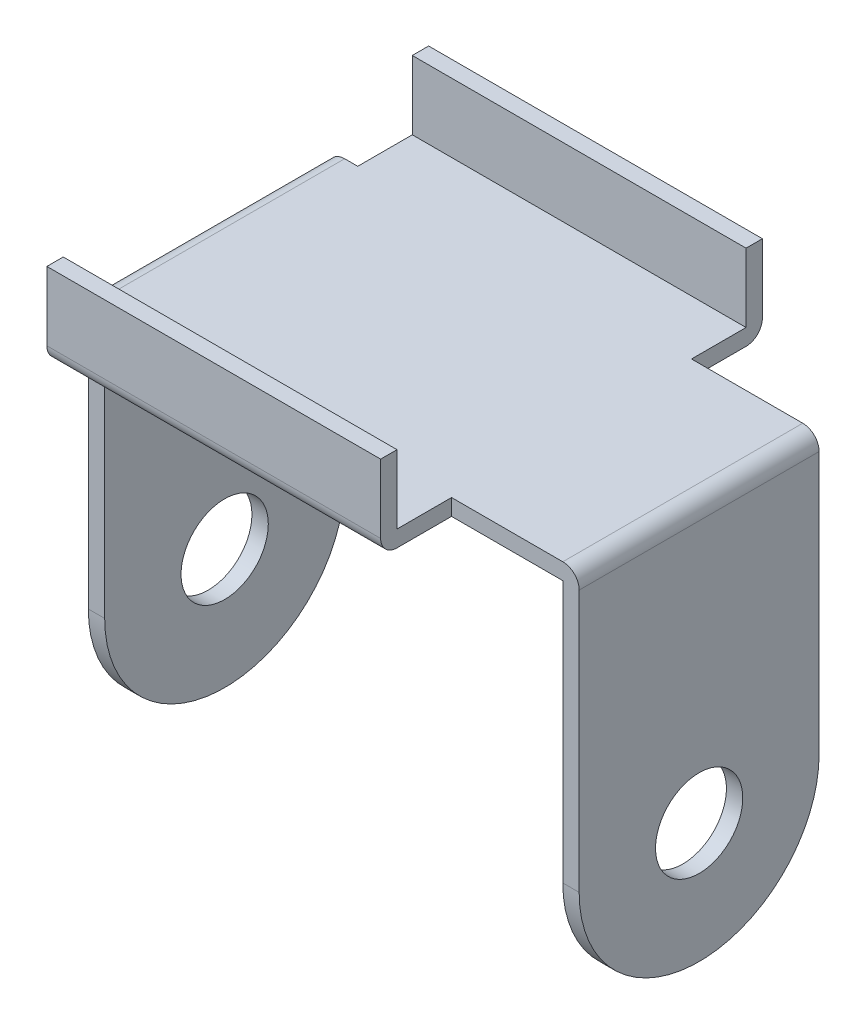
ISO-10303-21;
HEADER;
FILE_DESCRIPTION(('STEP AP214'),'2;1');
FILE_NAME('part.step','',(''),(''),'','','');
FILE_SCHEMA(('AUTOMOTIVE_DESIGN { 1 0 10303 214 1 1 1 1 }'));
ENDSEC;
DATA;
#1=APPLICATION_CONTEXT('core data for automotive mechanical design processes');
#2=APPLICATION_PROTOCOL_DEFINITION('international standard','automotive_design',2000,#1);
#3=PRODUCT_CONTEXT('',#1,'mechanical');
#4=PRODUCT('Part','Part','',(#3));
#5=PRODUCT_RELATED_PRODUCT_CATEGORY('part','',(#4));
#6=PRODUCT_DEFINITION_FORMATION('','',#4);
#7=PRODUCT_DEFINITION_CONTEXT('part definition',#1,'design');
#8=PRODUCT_DEFINITION('design','',#6,#7);
#9=PRODUCT_DEFINITION_SHAPE('','',#8);
#10=(LENGTH_UNIT() NAMED_UNIT(*) SI_UNIT(.MILLI.,.METRE.));
#11=(NAMED_UNIT(*) PLANE_ANGLE_UNIT() SI_UNIT($,.RADIAN.));
#12=(NAMED_UNIT(*) SI_UNIT($,.STERADIAN.) SOLID_ANGLE_UNIT());
#13=UNCERTAINTY_MEASURE_WITH_UNIT(LENGTH_MEASURE(1.E-05),#10,'distance_accuracy_value','');
#14=(GEOMETRIC_REPRESENTATION_CONTEXT(3) GLOBAL_UNCERTAINTY_ASSIGNED_CONTEXT((#13)) GLOBAL_UNIT_ASSIGNED_CONTEXT((#10,
#11,#12)) REPRESENTATION_CONTEXT('',''));
#15=CARTESIAN_POINT('',(0.,0.,0.));
#16=DIRECTION('',(0.,0.,1.));
#17=DIRECTION('',(1.,0.,0.));
#18=AXIS2_PLACEMENT_3D('',#15,#16,#17);
#19=CARTESIAN_POINT('',(22.5,25.5,11.));
#20=DIRECTION('',(0.,1.,0.));
#21=DIRECTION('',(0.,0.,1.));
#22=AXIS2_PLACEMENT_3D('',#19,#20,#21);
#23=PLANE('',#22);
#24=DIRECTION('',(-1.,0.,0.));
#25=VECTOR('',#24,1.);
#26=CARTESIAN_POINT('',(22.5,25.5,-11.));
#27=LINE('',#26,#25);
#28=CARTESIAN_POINT('',(-19.8,25.5,-11.));
#29=VERTEX_POINT('',#28);
#30=CARTESIAN_POINT('',(-21.,25.5,-11.));
#31=VERTEX_POINT('',#30);
#32=EDGE_CURVE('E314',#29,#31,#27,.T.);
#33=ORIENTED_EDGE('',*,*,#32,.T.);
#34=DIRECTION('',(0.,0.,-1.));
#35=VECTOR('',#34,1.);
#36=CARTESIAN_POINT('',(-21.,25.5,11.));
#37=LINE('',#36,#35);
#38=CARTESIAN_POINT('',(-21.,25.5,11.));
#39=VERTEX_POINT('',#38);
#40=EDGE_CURVE('E362',#31,#39,#37,.F.);
#41=ORIENTED_EDGE('',*,*,#40,.T.);
#42=DIRECTION('',(-1.,0.,0.));
#43=VECTOR('',#42,1.);
#44=CARTESIAN_POINT('',(22.5,25.5,11.));
#45=LINE('',#44,#43);
#46=CARTESIAN_POINT('',(-19.8,25.4999999999994,11.));
#47=VERTEX_POINT('',#46);
#48=EDGE_CURVE('E324',#47,#39,#45,.T.);
#49=ORIENTED_EDGE('',*,*,#48,.F.);
#50=DIRECTION('',(0.,0.,-1.));
#51=VECTOR('',#50,1.);
#52=CARTESIAN_POINT('',(-19.8,25.4999999999994,17.5));
#53=LINE('',#52,#51);
#54=CARTESIAN_POINT('',(-19.8,25.5,15.9999999999997));
#55=VERTEX_POINT('',#54);
#56=EDGE_CURVE('E238',#55,#47,#53,.T.);
#57=ORIENTED_EDGE('',*,*,#56,.F.);
#58=DIRECTION('',(-1.,0.,0.));
#59=VECTOR('',#58,1.);
#60=CARTESIAN_POINT('',(-19.8,25.5,15.9999999999997));
#61=LINE('',#60,#59);
#62=CARTESIAN_POINT('',(10.8,25.5,16.));
#63=VERTEX_POINT('',#62);
#64=EDGE_CURVE('E212',#63,#55,#61,.T.);
#65=ORIENTED_EDGE('',*,*,#64,.F.);
#66=DIRECTION('',(0.,0.,-1.));
#67=VECTOR('',#66,1.);
#68=CARTESIAN_POINT('',(10.8,25.4999999999994,17.5));
#69=LINE('',#68,#67);
#70=CARTESIAN_POINT('',(10.8,25.4999999999994,11.));
#71=VERTEX_POINT('',#70);
#72=EDGE_CURVE('E218',#63,#71,#69,.T.);
#73=ORIENTED_EDGE('',*,*,#72,.T.);
#74=CARTESIAN_POINT('',(21.,25.5,11.));
#75=VERTEX_POINT('',#74);
#76=EDGE_CURVE('E321',#75,#71,#45,.T.);
#77=ORIENTED_EDGE('',*,*,#76,.F.);
#78=DIRECTION('',(0.,0.,-1.));
#79=VECTOR('',#78,1.);
#80=CARTESIAN_POINT('',(21.,25.5,-11.));
#81=LINE('',#80,#79);
#82=CARTESIAN_POINT('',(21.,25.5,-11.));
#83=VERTEX_POINT('',#82);
#84=EDGE_CURVE('E359',#75,#83,#81,.T.);
#85=ORIENTED_EDGE('',*,*,#84,.T.);
#86=CARTESIAN_POINT('',(10.8,25.5,-11.));
#87=VERTEX_POINT('',#86);
#88=EDGE_CURVE('E333',#83,#87,#27,.T.);
#89=ORIENTED_EDGE('',*,*,#88,.T.);
#90=DIRECTION('',(0.,0.,1.));
#91=VECTOR('',#90,1.);
#92=CARTESIAN_POINT('',(10.8,25.4999999999994,-17.5));
#93=LINE('',#92,#91);
#94=CARTESIAN_POINT('',(10.8,25.5,-15.9999999999997));
#95=VERTEX_POINT('',#94);
#96=EDGE_CURVE('E277',#95,#87,#93,.T.);
#97=ORIENTED_EDGE('',*,*,#96,.F.);
#98=DIRECTION('',(1.,0.,0.));
#99=VECTOR('',#98,1.);
#100=CARTESIAN_POINT('',(10.8,25.5,-15.9999999999997));
#101=LINE('',#100,#99);
#102=CARTESIAN_POINT('',(-19.8,25.4999999999994,-15.9999999999997));
#103=VERTEX_POINT('',#102);
#104=EDGE_CURVE('E240',#103,#95,#101,.T.);
#105=ORIENTED_EDGE('',*,*,#104,.F.);
#106=DIRECTION('',(0.,0.,1.));
#107=VECTOR('',#106,1.);
#108=CARTESIAN_POINT('',(-19.8,25.4999999999994,-17.5));
#109=LINE('',#108,#107);
#110=EDGE_CURVE('E267',#103,#29,#109,.T.);
#111=ORIENTED_EDGE('',*,*,#110,.T.);
#112=EDGE_LOOP('',(#33,#41,#49,#57,#65,#73,#77,#85,#89,#97,#105,#111));
#113=FACE_BOUND('',#112,.T.);
#114=ADVANCED_FACE('F32',(#113),#23,.T.);
#115=CARTESIAN_POINT('',(22.5,0.,11.));
#116=DIRECTION('',(0.,0.,1.));
#117=DIRECTION('',(1.,0.,0.));
#118=AXIS2_PLACEMENT_3D('',#115,#116,#117);
#119=PLANE('',#118);
#120=ORIENTED_EDGE('',*,*,#48,.T.);
#121=CARTESIAN_POINT('',(-21.,24.,11.));
#122=DIRECTION('',(0.,0.,1.));
#123=DIRECTION('',(1.,0.,0.));
#124=AXIS2_PLACEMENT_3D('',#121,#122,#123);
#125=CIRCLE('',#124,1.5);
#126=CARTESIAN_POINT('',(-22.5,24.,11.));
#127=VERTEX_POINT('',#126);
#128=EDGE_CURVE('E364',#39,#127,#125,.T.);
#129=ORIENTED_EDGE('',*,*,#128,.T.);
#130=DIRECTION('',(0.,1.,0.));
#131=VECTOR('',#130,1.);
#132=CARTESIAN_POINT('',(-22.5,0.,11.));
#133=LINE('',#132,#131);
#134=CARTESIAN_POINT('',(-22.5,0.,11.));
#135=VERTEX_POINT('',#134);
#136=EDGE_CURVE('E309',#135,#127,#133,.T.);
#137=ORIENTED_EDGE('',*,*,#136,.F.);
#138=DIRECTION('',(-1.,0.,0.));
#139=VECTOR('',#138,1.);
#140=CARTESIAN_POINT('',(22.5,0.,11.));
#141=LINE('',#140,#139);
#142=CARTESIAN_POINT('',(-20.9999999999999,0.,11.));
#143=VERTEX_POINT('',#142);
#144=EDGE_CURVE('E328',#143,#135,#141,.T.);
#145=ORIENTED_EDGE('',*,*,#144,.F.);
#146=DIRECTION('',(0.,-1.,0.));
#147=VECTOR('',#146,1.);
#148=CARTESIAN_POINT('',(-20.9999999999999,23.9999999999996,11.));
#149=LINE('',#148,#147);
#150=CARTESIAN_POINT('',(-20.9999999999999,23.9999999999996,11.));
#151=VERTEX_POINT('',#150);
#152=EDGE_CURVE('E280',#151,#143,#149,.T.);
#153=ORIENTED_EDGE('',*,*,#152,.F.);
#154=DIRECTION('',(-1.,0.,0.));
#155=VECTOR('',#154,1.);
#156=CARTESIAN_POINT('',(20.9999999999996,24.,11.));
#157=LINE('',#156,#155);
#158=CARTESIAN_POINT('',(-19.8,23.9999999999996,11.));
#159=VERTEX_POINT('',#158);
#160=EDGE_CURVE('E293',#159,#151,#157,.T.);
#161=ORIENTED_EDGE('',*,*,#160,.F.);
#162=DIRECTION('',(0.,-1.,0.));
#163=VECTOR('',#162,1.);
#164=CARTESIAN_POINT('',(-19.8,24.,11.));
#165=LINE('',#164,#163);
#166=EDGE_CURVE('E219',#47,#159,#165,.T.);
#167=ORIENTED_EDGE('',*,*,#166,.F.);
#168=EDGE_LOOP('',(#120,#129,#137,#145,#153,#161,#167));
#169=FACE_BOUND('',#168,.T.);
#170=ADVANCED_FACE('F370',(#169),#119,.T.);
#171=DIRECTION('',(0.,1.,0.));
#172=VECTOR('',#171,1.);
#173=CARTESIAN_POINT('',(22.5,0.,11.));
#174=LINE('',#173,#172);
#175=CARTESIAN_POINT('',(22.5,0.,11.));
#176=VERTEX_POINT('',#175);
#177=CARTESIAN_POINT('',(22.5,24.,11.));
#178=VERTEX_POINT('',#177);
#179=EDGE_CURVE('E312',#176,#178,#174,.T.);
#180=ORIENTED_EDGE('',*,*,#179,.T.);
#181=CARTESIAN_POINT('',(21.,24.,11.));
#182=DIRECTION('',(0.,0.,1.));
#183=DIRECTION('',(1.,0.,0.));
#184=AXIS2_PLACEMENT_3D('',#181,#182,#183);
#185=CIRCLE('',#184,1.5);
#186=EDGE_CURVE('E11',#178,#75,#185,.T.);
#187=ORIENTED_EDGE('',*,*,#186,.T.);
#188=ORIENTED_EDGE('',*,*,#76,.T.);
#189=DIRECTION('',(0.,1.,0.));
#190=VECTOR('',#189,1.);
#191=CARTESIAN_POINT('',(10.8,25.4999999999994,11.));
#192=LINE('',#191,#190);
#193=CARTESIAN_POINT('',(10.8,24.,11.));
#194=VERTEX_POINT('',#193);
#195=EDGE_CURVE('E222',#194,#71,#192,.T.);
#196=ORIENTED_EDGE('',*,*,#195,.F.);
#197=CARTESIAN_POINT('',(20.9999999999996,24.,11.));
#198=VERTEX_POINT('',#197);
#199=EDGE_CURVE('E285',#198,#194,#157,.T.);
#200=ORIENTED_EDGE('',*,*,#199,.F.);
#201=DIRECTION('',(0.,1.,0.));
#202=VECTOR('',#201,1.);
#203=CARTESIAN_POINT('',(20.9999999999995,-17.8826561140681,11.));
#204=LINE('',#203,#202);
#205=CARTESIAN_POINT('',(20.9999999999996,0.,11.));
#206=VERTEX_POINT('',#205);
#207=EDGE_CURVE('E291',#206,#198,#204,.T.);
#208=ORIENTED_EDGE('',*,*,#207,.F.);
#209=EDGE_CURVE('E325',#176,#206,#141,.T.);
#210=ORIENTED_EDGE('',*,*,#209,.F.);
#211=EDGE_LOOP('',(#180,#187,#188,#196,#200,#208,#210));
#212=FACE_BOUND('',#211,.T.);
#213=ADVANCED_FACE('F427',(#212),#119,.T.);
#214=CARTESIAN_POINT('',(22.5,25.5,-11.));
#215=DIRECTION('',(0.,0.,-1.));
#216=DIRECTION('',(-1.,0.,0.));
#217=AXIS2_PLACEMENT_3D('',#214,#215,#216);
#218=PLANE('',#217);
#219=ORIENTED_EDGE('',*,*,#88,.F.);
#220=CARTESIAN_POINT('',(21.,24.,-11.));
#221=DIRECTION('',(0.,0.,-1.));
#222=DIRECTION('',(-1.,0.,0.));
#223=AXIS2_PLACEMENT_3D('',#220,#221,#222);
#224=CIRCLE('',#223,1.5);
#225=CARTESIAN_POINT('',(22.5,24.,-11.));
#226=VERTEX_POINT('',#225);
#227=EDGE_CURVE('E54',#83,#226,#224,.T.);
#228=ORIENTED_EDGE('',*,*,#227,.T.);
#229=DIRECTION('',(0.,-1.,0.));
#230=VECTOR('',#229,1.);
#231=CARTESIAN_POINT('',(22.5,25.5,-11.));
#232=LINE('',#231,#230);
#233=CARTESIAN_POINT('',(22.5,0.,-11.));
#234=VERTEX_POINT('',#233);
#235=EDGE_CURVE('E306',#226,#234,#232,.T.);
#236=ORIENTED_EDGE('',*,*,#235,.T.);
#237=DIRECTION('',(-1.,0.,0.));
#238=VECTOR('',#237,1.);
#239=CARTESIAN_POINT('',(22.5,0.,-11.));
#240=LINE('',#239,#238);
#241=CARTESIAN_POINT('',(20.9999999999996,0.,-11.));
#242=VERTEX_POINT('',#241);
#243=EDGE_CURVE('E329',#234,#242,#240,.T.);
#244=ORIENTED_EDGE('',*,*,#243,.T.);
#245=DIRECTION('',(0.,-1.,0.));
#246=VECTOR('',#245,1.);
#247=CARTESIAN_POINT('',(20.9999999999996,25.5,-11.));
#248=LINE('',#247,#246);
#249=CARTESIAN_POINT('',(20.9999999999996,24.,-11.));
#250=VERTEX_POINT('',#249);
#251=EDGE_CURVE('E323',#250,#242,#248,.T.);
#252=ORIENTED_EDGE('',*,*,#251,.F.);
#253=DIRECTION('',(-1.,0.,0.));
#254=VECTOR('',#253,1.);
#255=CARTESIAN_POINT('',(20.9999999999996,24.,-11.));
#256=LINE('',#255,#254);
#257=CARTESIAN_POINT('',(10.8,23.9999999999999,-11.));
#258=VERTEX_POINT('',#257);
#259=EDGE_CURVE('E286',#250,#258,#256,.T.);
#260=ORIENTED_EDGE('',*,*,#259,.T.);
#261=DIRECTION('',(0.,-1.,0.));
#262=VECTOR('',#261,1.);
#263=CARTESIAN_POINT('',(10.8,24.,-11.));
#264=LINE('',#263,#262);
#265=EDGE_CURVE('E260',#87,#258,#264,.T.);
#266=ORIENTED_EDGE('',*,*,#265,.F.);
#267=EDGE_LOOP('',(#219,#228,#236,#244,#252,#260,#266));
#268=FACE_BOUND('',#267,.T.);
#269=ADVANCED_FACE('F418',(#268),#218,.T.);
#270=DIRECTION('',(0.,-1.,0.));
#271=VECTOR('',#270,1.);
#272=CARTESIAN_POINT('',(-22.5,25.5,-11.));
#273=LINE('',#272,#271);
#274=CARTESIAN_POINT('',(-22.5,24.,-11.));
#275=VERTEX_POINT('',#274);
#276=CARTESIAN_POINT('',(-22.5,0.,-11.));
#277=VERTEX_POINT('',#276);
#278=EDGE_CURVE('E305',#275,#277,#273,.T.);
#279=ORIENTED_EDGE('',*,*,#278,.F.);
#280=CARTESIAN_POINT('',(-21.,24.,-11.));
#281=DIRECTION('',(0.,0.,-1.));
#282=DIRECTION('',(-1.,0.,0.));
#283=AXIS2_PLACEMENT_3D('',#280,#281,#282);
#284=CIRCLE('',#283,1.5);
#285=EDGE_CURVE('E357',#275,#31,#284,.T.);
#286=ORIENTED_EDGE('',*,*,#285,.T.);
#287=ORIENTED_EDGE('',*,*,#32,.F.);
#288=DIRECTION('',(0.,1.,0.));
#289=VECTOR('',#288,1.);
#290=CARTESIAN_POINT('',(-19.8,25.4999999999994,-11.));
#291=LINE('',#290,#289);
#292=CARTESIAN_POINT('',(-19.8,24.,-11.));
#293=VERTEX_POINT('',#292);
#294=EDGE_CURVE('E265',#293,#29,#291,.T.);
#295=ORIENTED_EDGE('',*,*,#294,.F.);
#296=CARTESIAN_POINT('',(-20.9999999999999,23.9999999999996,-11.));
#297=VERTEX_POINT('',#296);
#298=EDGE_CURVE('E284',#293,#297,#256,.T.);
#299=ORIENTED_EDGE('',*,*,#298,.T.);
#300=DIRECTION('',(0.,-1.,0.));
#301=VECTOR('',#300,1.);
#302=CARTESIAN_POINT('',(-20.9999999999999,23.9999999999996,-11.));
#303=LINE('',#302,#301);
#304=CARTESIAN_POINT('',(-20.9999999999999,0.,-11.));
#305=VERTEX_POINT('',#304);
#306=EDGE_CURVE('E281',#297,#305,#303,.T.);
#307=ORIENTED_EDGE('',*,*,#306,.T.);
#308=EDGE_CURVE('E332',#305,#277,#240,.T.);
#309=ORIENTED_EDGE('',*,*,#308,.T.);
#310=EDGE_LOOP('',(#279,#286,#287,#295,#299,#307,#309));
#311=FACE_BOUND('',#310,.T.);
#312=ADVANCED_FACE('F385',(#311),#218,.T.);
#313=CARTESIAN_POINT('',(22.5,0.,0.));
#314=DIRECTION('',(-1.,0.,0.));
#315=DIRECTION('',(0.,0.,1.));
#316=AXIS2_PLACEMENT_3D('',#313,#314,#315);
#317=CYLINDRICAL_SURFACE('',#316,11.);
#318=CARTESIAN_POINT('',(-20.9999999999999,0.,0.));
#319=DIRECTION('',(-1.,0.,0.));
#320=DIRECTION('',(0.,0.,1.));
#321=AXIS2_PLACEMENT_3D('',#318,#319,#320);
#322=CIRCLE('',#321,11.);
#323=EDGE_CURVE('E303',#143,#305,#322,.F.);
#324=ORIENTED_EDGE('',*,*,#323,.F.);
#325=ORIENTED_EDGE('',*,*,#144,.T.);
#326=CARTESIAN_POINT('',(-22.5,0.,0.));
#327=DIRECTION('',(-1.,0.,0.));
#328=DIRECTION('',(0.,0.,1.));
#329=AXIS2_PLACEMENT_3D('',#326,#327,#328);
#330=CIRCLE('',#329,11.);
#331=EDGE_CURVE('E316',#277,#135,#330,.T.);
#332=ORIENTED_EDGE('',*,*,#331,.F.);
#333=ORIENTED_EDGE('',*,*,#308,.F.);
#334=EDGE_LOOP('',(#324,#325,#332,#333));
#335=FACE_BOUND('',#334,.T.);
#336=ADVANCED_FACE('F478',(#335),#317,.T.);
#337=CARTESIAN_POINT('',(20.9999999999996,0.,0.));
#338=DIRECTION('',(1.,0.,0.));
#339=DIRECTION('',(0.,1.,0.));
#340=AXIS2_PLACEMENT_3D('',#337,#338,#339);
#341=CIRCLE('',#340,11.);
#342=EDGE_CURVE('E299',#242,#206,#341,.F.);
#343=ORIENTED_EDGE('',*,*,#342,.F.);
#344=ORIENTED_EDGE('',*,*,#243,.F.);
#345=CARTESIAN_POINT('',(22.5,0.,0.));
#346=DIRECTION('',(-1.,0.,0.));
#347=DIRECTION('',(0.,0.,1.));
#348=AXIS2_PLACEMENT_3D('',#345,#346,#347);
#349=CIRCLE('',#348,11.);
#350=EDGE_CURVE('E308',#234,#176,#349,.T.);
#351=ORIENTED_EDGE('',*,*,#350,.T.);
#352=ORIENTED_EDGE('',*,*,#209,.T.);
#353=EDGE_LOOP('',(#343,#344,#351,#352));
#354=FACE_BOUND('',#353,.T.);
#355=ADVANCED_FACE('F430',(#354),#317,.T.);
#356=CARTESIAN_POINT('',(22.5,0.,0.));
#357=DIRECTION('',(-1.,0.,0.));
#358=DIRECTION('',(0.,0.,1.));
#359=AXIS2_PLACEMENT_3D('',#356,#357,#358);
#360=PLANE('',#359);
#361=CARTESIAN_POINT('',(22.5,0.,0.));
#362=DIRECTION('',(-1.,0.,0.));
#363=DIRECTION('',(0.,0.,1.));
#364=AXIS2_PLACEMENT_3D('',#361,#362,#363);
#365=CIRCLE('',#364,3.99999999999999);
#366=CARTESIAN_POINT('',(22.5,0.,3.99999999999999));
#367=VERTEX_POINT('',#366);
#368=EDGE_CURVE('E450',#367,#367,#365,.T.);
#369=ORIENTED_EDGE('',*,*,#368,.T.);
#370=EDGE_LOOP('',(#369));
#371=FACE_BOUND('',#370,.T.);
#372=ORIENTED_EDGE('',*,*,#235,.F.);
#373=DIRECTION('',(0.,0.,-1.));
#374=VECTOR('',#373,1.);
#375=CARTESIAN_POINT('',(22.5,24.,11.));
#376=LINE('',#375,#374);
#377=EDGE_CURVE('E40',#226,#178,#376,.F.);
#378=ORIENTED_EDGE('',*,*,#377,.T.);
#379=ORIENTED_EDGE('',*,*,#179,.F.);
#380=ORIENTED_EDGE('',*,*,#350,.F.);
#381=EDGE_LOOP('',(#372,#378,#379,#380));
#382=FACE_BOUND('',#381,.T.);
#383=ADVANCED_FACE('F433',(#371,#382),#360,.F.);
#384=CARTESIAN_POINT('',(-22.5,0.,0.));
#385=DIRECTION('',(-1.,0.,0.));
#386=DIRECTION('',(0.,0.,1.));
#387=AXIS2_PLACEMENT_3D('',#384,#385,#386);
#388=PLANE('',#387);
#389=CARTESIAN_POINT('',(-22.500000000001,1.26851654180804E-13,0.));
#390=DIRECTION('',(1.,0.,0.));
#391=DIRECTION('',(0.,0.,-1.));
#392=AXIS2_PLACEMENT_3D('',#389,#390,#391);
#393=CIRCLE('',#392,3.99999999999999);
#394=CARTESIAN_POINT('',(-22.500000000001,1.26851654180804E-13,-3.99999999999999));
#395=VERTEX_POINT('',#394);
#396=EDGE_CURVE('E457',#395,#395,#393,.T.);
#397=ORIENTED_EDGE('',*,*,#396,.T.);
#398=EDGE_LOOP('',(#397));
#399=FACE_BOUND('',#398,.T.);
#400=ORIENTED_EDGE('',*,*,#136,.T.);
#401=DIRECTION('',(0.,0.,-1.));
#402=VECTOR('',#401,1.);
#403=CARTESIAN_POINT('',(-22.5,24.,0.));
#404=LINE('',#403,#402);
#405=EDGE_CURVE('E354',#127,#275,#404,.T.);
#406=ORIENTED_EDGE('',*,*,#405,.T.);
#407=ORIENTED_EDGE('',*,*,#278,.T.);
#408=ORIENTED_EDGE('',*,*,#331,.T.);
#409=EDGE_LOOP('',(#400,#406,#407,#408));
#410=FACE_BOUND('',#409,.T.);
#411=ADVANCED_FACE('F378',(#399,#410),#388,.T.);
#412=CARTESIAN_POINT('',(-20.9999999999999,23.9999999999996,-11.));
#413=DIRECTION('',(-1.,0.,0.));
#414=DIRECTION('',(0.,0.,1.));
#415=AXIS2_PLACEMENT_3D('',#412,#413,#414);
#416=PLANE('',#415);
#417=CARTESIAN_POINT('',(-20.9999999999999,1.26851654180804E-13,0.));
#418=DIRECTION('',(1.,0.,0.));
#419=DIRECTION('',(0.,0.,-1.));
#420=AXIS2_PLACEMENT_3D('',#417,#418,#419);
#421=CIRCLE('',#420,3.99999999999999);
#422=CARTESIAN_POINT('',(-20.9999999999999,1.26851654180804E-13,-3.99999999999999));
#423=VERTEX_POINT('',#422);
#424=EDGE_CURVE('E462',#423,#423,#421,.T.);
#425=ORIENTED_EDGE('',*,*,#424,.F.);
#426=EDGE_LOOP('',(#425));
#427=FACE_BOUND('',#426,.T.);
#428=ORIENTED_EDGE('',*,*,#323,.T.);
#429=ORIENTED_EDGE('',*,*,#306,.F.);
#430=DIRECTION('',(0.,0.,1.));
#431=VECTOR('',#430,1.);
#432=CARTESIAN_POINT('',(-20.9999999999999,23.9999999999996,-11.));
#433=LINE('',#432,#431);
#434=EDGE_CURVE('E296',#297,#151,#433,.T.);
#435=ORIENTED_EDGE('',*,*,#434,.T.);
#436=ORIENTED_EDGE('',*,*,#152,.T.);
#437=EDGE_LOOP('',(#428,#429,#435,#436));
#438=FACE_BOUND('',#437,.T.);
#439=ADVANCED_FACE('F468',(#427,#438),#416,.F.);
#440=CARTESIAN_POINT('',(20.9999999999996,24.,-11.));
#441=DIRECTION('',(0.,1.,0.));
#442=DIRECTION('',(-1.,0.,0.));
#443=AXIS2_PLACEMENT_3D('',#440,#441,#442);
#444=PLANE('',#443);
#445=DIRECTION('',(0.,0.,-1.));
#446=VECTOR('',#445,1.);
#447=CARTESIAN_POINT('',(10.8,24.,17.5));
#448=LINE('',#447,#446);
#449=CARTESIAN_POINT('',(10.8,24.,16.));
#450=VERTEX_POINT('',#449);
#451=EDGE_CURVE('E234',#450,#194,#448,.T.);
#452=ORIENTED_EDGE('',*,*,#451,.F.);
#453=DIRECTION('',(1.,0.,0.));
#454=VECTOR('',#453,1.);
#455=CARTESIAN_POINT('',(20.9999999999996,24.,16.));
#456=LINE('',#455,#454);
#457=CARTESIAN_POINT('',(-19.8,24.,16.));
#458=VERTEX_POINT('',#457);
#459=EDGE_CURVE('E343',#450,#458,#456,.F.);
#460=ORIENTED_EDGE('',*,*,#459,.T.);
#461=DIRECTION('',(0.,0.,-1.));
#462=VECTOR('',#461,1.);
#463=CARTESIAN_POINT('',(-19.8,24.,17.5));
#464=LINE('',#463,#462);
#465=EDGE_CURVE('E236',#458,#159,#464,.T.);
#466=ORIENTED_EDGE('',*,*,#465,.T.);
#467=ORIENTED_EDGE('',*,*,#160,.T.);
#468=ORIENTED_EDGE('',*,*,#434,.F.);
#469=ORIENTED_EDGE('',*,*,#298,.F.);
#470=DIRECTION('',(0.,0.,1.));
#471=VECTOR('',#470,1.);
#472=CARTESIAN_POINT('',(-19.8,24.,-17.5));
#473=LINE('',#472,#471);
#474=CARTESIAN_POINT('',(-19.8,24.,-16.));
#475=VERTEX_POINT('',#474);
#476=EDGE_CURVE('E273',#475,#293,#473,.T.);
#477=ORIENTED_EDGE('',*,*,#476,.F.);
#478=DIRECTION('',(-1.,0.,0.));
#479=VECTOR('',#478,1.);
#480=CARTESIAN_POINT('',(20.9999999999996,24.,-16.));
#481=LINE('',#480,#479);
#482=CARTESIAN_POINT('',(10.8,24.,-16.));
#483=VERTEX_POINT('',#482);
#484=EDGE_CURVE('E341',#475,#483,#481,.F.);
#485=ORIENTED_EDGE('',*,*,#484,.T.);
#486=DIRECTION('',(0.,0.,1.));
#487=VECTOR('',#486,1.);
#488=CARTESIAN_POINT('',(10.8,24.,-17.5));
#489=LINE('',#488,#487);
#490=EDGE_CURVE('E275',#483,#258,#489,.T.);
#491=ORIENTED_EDGE('',*,*,#490,.T.);
#492=ORIENTED_EDGE('',*,*,#259,.F.);
#493=DIRECTION('',(0.,0.,1.));
#494=VECTOR('',#493,1.);
#495=CARTESIAN_POINT('',(20.9999999999996,24.,-11.));
#496=LINE('',#495,#494);
#497=EDGE_CURVE('E289',#250,#198,#496,.T.);
#498=ORIENTED_EDGE('',*,*,#497,.T.);
#499=ORIENTED_EDGE('',*,*,#199,.T.);
#500=EDGE_LOOP('',(#452,#460,#466,#467,#468,#469,#477,#485,#491,#492,#498,#499));
#501=FACE_BOUND('',#500,.T.);
#502=ADVANCED_FACE('F413',(#501),#444,.F.);
#503=CARTESIAN_POINT('',(20.9999999999995,-17.8826561140681,-11.));
#504=DIRECTION('',(1.,0.,0.));
#505=DIRECTION('',(0.,1.,0.));
#506=AXIS2_PLACEMENT_3D('',#503,#504,#505);
#507=PLANE('',#506);
#508=CARTESIAN_POINT('',(20.9999999999996,0.,0.));
#509=DIRECTION('',(-1.,0.,0.));
#510=DIRECTION('',(0.,0.,1.));
#511=AXIS2_PLACEMENT_3D('',#508,#509,#510);
#512=CIRCLE('',#511,3.99999999999999);
#513=CARTESIAN_POINT('',(20.9999999999996,0.,3.99999999999999));
#514=VERTEX_POINT('',#513);
#515=EDGE_CURVE('E452',#514,#514,#512,.T.);
#516=ORIENTED_EDGE('',*,*,#515,.F.);
#517=EDGE_LOOP('',(#516));
#518=FACE_BOUND('',#517,.T.);
#519=ORIENTED_EDGE('',*,*,#342,.T.);
#520=ORIENTED_EDGE('',*,*,#207,.T.);
#521=ORIENTED_EDGE('',*,*,#497,.F.);
#522=ORIENTED_EDGE('',*,*,#251,.T.);
#523=EDGE_LOOP('',(#519,#520,#521,#522));
#524=FACE_BOUND('',#523,.T.);
#525=ADVANCED_FACE('F423',(#518,#524),#507,.F.);
#526=CARTESIAN_POINT('',(10.8,24.,-17.5));
#527=DIRECTION('',(-1.,0.,0.));
#528=DIRECTION('',(0.,0.,1.));
#529=AXIS2_PLACEMENT_3D('',#526,#527,#528);
#530=PLANE('',#529);
#531=ORIENTED_EDGE('',*,*,#490,.F.);
#532=CARTESIAN_POINT('',(10.8,25.4999999999999,-16.));
#533=DIRECTION('',(-1.,0.,0.));
#534=DIRECTION('',(0.,0.,1.));
#535=AXIS2_PLACEMENT_3D('',#532,#533,#534);
#536=CIRCLE('',#535,1.5);
#537=CARTESIAN_POINT('',(10.8,25.4999999999999,-17.5));
#538=VERTEX_POINT('',#537);
#539=EDGE_CURVE('E352',#483,#538,#536,.F.);
#540=ORIENTED_EDGE('',*,*,#539,.T.);
#541=DIRECTION('',(0.,-1.,0.));
#542=VECTOR('',#541,1.);
#543=CARTESIAN_POINT('',(10.8,24.,-17.5));
#544=LINE('',#543,#542);
#545=CARTESIAN_POINT('',(10.8,31.8000000000006,-17.5));
#546=VERTEX_POINT('',#545);
#547=EDGE_CURVE('E261',#546,#538,#544,.T.);
#548=ORIENTED_EDGE('',*,*,#547,.F.);
#549=DIRECTION('',(0.,0.,-1.));
#550=VECTOR('',#549,1.);
#551=CARTESIAN_POINT('',(10.8,31.8000000000006,-17.5));
#552=LINE('',#551,#550);
#553=CARTESIAN_POINT('',(10.8,31.8000000000006,-15.9999999999997));
#554=VERTEX_POINT('',#553);
#555=EDGE_CURVE('E246',#554,#546,#552,.T.);
#556=ORIENTED_EDGE('',*,*,#555,.F.);
#557=DIRECTION('',(0.,-1.,0.));
#558=VECTOR('',#557,1.);
#559=CARTESIAN_POINT('',(10.8,31.8000000000006,-15.9999999999997));
#560=LINE('',#559,#558);
#561=EDGE_CURVE('E252',#554,#95,#560,.T.);
#562=ORIENTED_EDGE('',*,*,#561,.T.);
#563=ORIENTED_EDGE('',*,*,#96,.T.);
#564=ORIENTED_EDGE('',*,*,#265,.T.);
#565=EDGE_LOOP('',(#531,#540,#548,#556,#562,#563,#564));
#566=FACE_BOUND('',#565,.T.);
#567=ADVANCED_FACE('F416',(#566),#530,.F.);
#568=CARTESIAN_POINT('',(-19.8,25.4999999999994,-17.5));
#569=DIRECTION('',(1.,0.,0.));
#570=DIRECTION('',(0.,0.,-1.));
#571=AXIS2_PLACEMENT_3D('',#568,#569,#570);
#572=PLANE('',#571);
#573=DIRECTION('',(0.,1.,0.));
#574=VECTOR('',#573,1.);
#575=CARTESIAN_POINT('',(-19.8,25.4999999999994,-17.5));
#576=LINE('',#575,#574);
#577=CARTESIAN_POINT('',(-19.8,25.4999999999996,-17.5));
#578=VERTEX_POINT('',#577);
#579=CARTESIAN_POINT('',(-19.7999999999995,31.8000000000006,-17.5));
#580=VERTEX_POINT('',#579);
#581=EDGE_CURVE('E264',#578,#580,#576,.T.);
#582=ORIENTED_EDGE('',*,*,#581,.F.);
#583=CARTESIAN_POINT('',(-19.8,25.4999999999996,-16.));
#584=DIRECTION('',(1.,0.,0.));
#585=DIRECTION('',(0.,0.,-1.));
#586=AXIS2_PLACEMENT_3D('',#583,#584,#585);
#587=CIRCLE('',#586,1.5);
#588=EDGE_CURVE('E350',#578,#475,#587,.F.);
#589=ORIENTED_EDGE('',*,*,#588,.T.);
#590=ORIENTED_EDGE('',*,*,#476,.T.);
#591=ORIENTED_EDGE('',*,*,#294,.T.);
#592=ORIENTED_EDGE('',*,*,#110,.F.);
#593=DIRECTION('',(0.,-1.,0.));
#594=VECTOR('',#593,1.);
#595=CARTESIAN_POINT('',(-19.7999999999995,31.8000000000006,-15.9999999999997));
#596=LINE('',#595,#594);
#597=CARTESIAN_POINT('',(-19.7999999999995,31.8000000000006,-15.9999999999997));
#598=VERTEX_POINT('',#597);
#599=EDGE_CURVE('E257',#598,#103,#596,.T.);
#600=ORIENTED_EDGE('',*,*,#599,.F.);
#601=DIRECTION('',(0.,0.,1.));
#602=VECTOR('',#601,1.);
#603=CARTESIAN_POINT('',(-19.7999999999995,31.8000000000006,-15.9999999999997));
#604=LINE('',#603,#602);
#605=EDGE_CURVE('E241',#580,#598,#604,.T.);
#606=ORIENTED_EDGE('',*,*,#605,.F.);
#607=EDGE_LOOP('',(#582,#589,#590,#591,#592,#600,#606));
#608=FACE_BOUND('',#607,.T.);
#609=ADVANCED_FACE('F393',(#608),#572,.F.);
#610=CARTESIAN_POINT('',(0.,0.,-17.5));
#611=DIRECTION('',(0.,0.,1.));
#612=DIRECTION('',(1.,0.,0.));
#613=AXIS2_PLACEMENT_3D('',#610,#611,#612);
#614=PLANE('',#613);
#615=ORIENTED_EDGE('',*,*,#547,.T.);
#616=DIRECTION('',(-1.,0.,0.));
#617=VECTOR('',#616,1.);
#618=CARTESIAN_POINT('',(-2.52773992213764E-13,25.4999999999998,-17.5));
#619=LINE('',#618,#617);
#620=EDGE_CURVE('E347',#538,#578,#619,.T.);
#621=ORIENTED_EDGE('',*,*,#620,.T.);
#622=ORIENTED_EDGE('',*,*,#581,.T.);
#623=DIRECTION('',(-1.,0.,0.));
#624=VECTOR('',#623,1.);
#625=CARTESIAN_POINT('',(-19.7999999999995,31.8000000000006,-17.5));
#626=LINE('',#625,#624);
#627=EDGE_CURVE('E249',#546,#580,#626,.T.);
#628=ORIENTED_EDGE('',*,*,#627,.F.);
#629=EDGE_LOOP('',(#615,#621,#622,#628));
#630=FACE_BOUND('',#629,.T.);
#631=ADVANCED_FACE('F404',(#630),#614,.F.);
#632=CARTESIAN_POINT('',(10.8,31.8000000000006,-15.9999999999997));
#633=DIRECTION('',(0.,0.,-1.));
#634=DIRECTION('',(0.,1.,0.));
#635=AXIS2_PLACEMENT_3D('',#632,#633,#634);
#636=PLANE('',#635);
#637=ORIENTED_EDGE('',*,*,#104,.T.);
#638=ORIENTED_EDGE('',*,*,#561,.F.);
#639=DIRECTION('',(1.,0.,0.));
#640=VECTOR('',#639,1.);
#641=CARTESIAN_POINT('',(10.8,31.8000000000006,-15.9999999999997));
#642=LINE('',#641,#640);
#643=EDGE_CURVE('E244',#598,#554,#642,.T.);
#644=ORIENTED_EDGE('',*,*,#643,.F.);
#645=ORIENTED_EDGE('',*,*,#599,.T.);
#646=EDGE_LOOP('',(#637,#638,#644,#645));
#647=FACE_BOUND('',#646,.T.);
#648=ADVANCED_FACE('F396',(#647),#636,.F.);
#649=CARTESIAN_POINT('',(0.,31.8000000000006,0.));
#650=DIRECTION('',(0.,-1.,0.));
#651=DIRECTION('',(0.,0.,-1.));
#652=AXIS2_PLACEMENT_3D('',#649,#650,#651);
#653=PLANE('',#652);
#654=ORIENTED_EDGE('',*,*,#605,.T.);
#655=ORIENTED_EDGE('',*,*,#643,.T.);
#656=ORIENTED_EDGE('',*,*,#555,.T.);
#657=ORIENTED_EDGE('',*,*,#627,.T.);
#658=EDGE_LOOP('',(#654,#655,#656,#657));
#659=FACE_BOUND('',#658,.T.);
#660=ADVANCED_FACE('F400',(#659),#653,.F.);
#661=CARTESIAN_POINT('',(-19.8,24.,17.5));
#662=DIRECTION('',(1.,0.,0.));
#663=DIRECTION('',(0.,0.,-1.));
#664=AXIS2_PLACEMENT_3D('',#661,#662,#663);
#665=PLANE('',#664);
#666=ORIENTED_EDGE('',*,*,#465,.F.);
#667=CARTESIAN_POINT('',(-19.8,25.4999999999996,16.));
#668=DIRECTION('',(1.,0.,0.));
#669=DIRECTION('',(0.,0.,-1.));
#670=AXIS2_PLACEMENT_3D('',#667,#668,#669);
#671=CIRCLE('',#670,1.5);
#672=CARTESIAN_POINT('',(-19.8,25.4999999999996,17.5));
#673=VERTEX_POINT('',#672);
#674=EDGE_CURVE('E345',#458,#673,#671,.F.);
#675=ORIENTED_EDGE('',*,*,#674,.T.);
#676=DIRECTION('',(0.,-1.,0.));
#677=VECTOR('',#676,1.);
#678=CARTESIAN_POINT('',(-19.8,24.,17.5));
#679=LINE('',#678,#677);
#680=CARTESIAN_POINT('',(-19.8,31.8000000000006,17.5));
#681=VERTEX_POINT('',#680);
#682=EDGE_CURVE('E227',#681,#673,#679,.T.);
#683=ORIENTED_EDGE('',*,*,#682,.F.);
#684=DIRECTION('',(0.,0.,1.));
#685=VECTOR('',#684,1.);
#686=CARTESIAN_POINT('',(-19.8,31.8000000000006,17.5));
#687=LINE('',#686,#685);
#688=CARTESIAN_POINT('',(-19.8,31.8000000000006,15.9999999999997));
#689=VERTEX_POINT('',#688);
#690=EDGE_CURVE('E202',#689,#681,#687,.T.);
#691=ORIENTED_EDGE('',*,*,#690,.F.);
#692=DIRECTION('',(0.,-1.,0.));
#693=VECTOR('',#692,1.);
#694=CARTESIAN_POINT('',(-19.8,31.8000000000006,15.9999999999997));
#695=LINE('',#694,#693);
#696=EDGE_CURVE('E198',#689,#55,#695,.T.);
#697=ORIENTED_EDGE('',*,*,#696,.T.);
#698=ORIENTED_EDGE('',*,*,#56,.T.);
#699=ORIENTED_EDGE('',*,*,#166,.T.);
#700=EDGE_LOOP('',(#666,#675,#683,#691,#697,#698,#699));
#701=FACE_BOUND('',#700,.T.);
#702=ADVANCED_FACE('F445',(#701),#665,.F.);
#703=CARTESIAN_POINT('',(10.8,25.4999999999994,17.5));
#704=DIRECTION('',(-1.,0.,0.));
#705=DIRECTION('',(0.,0.,1.));
#706=AXIS2_PLACEMENT_3D('',#703,#704,#705);
#707=PLANE('',#706);
#708=DIRECTION('',(0.,1.,0.));
#709=VECTOR('',#708,1.);
#710=CARTESIAN_POINT('',(10.8,25.4999999999994,17.5));
#711=LINE('',#710,#709);
#712=CARTESIAN_POINT('',(10.8,25.4999999999999,17.5));
#713=VERTEX_POINT('',#712);
#714=CARTESIAN_POINT('',(10.8,31.8000000000006,17.5));
#715=VERTEX_POINT('',#714);
#716=EDGE_CURVE('E230',#713,#715,#711,.T.);
#717=ORIENTED_EDGE('',*,*,#716,.F.);
#718=CARTESIAN_POINT('',(10.8,25.4999999999999,16.));
#719=DIRECTION('',(-1.,0.,0.));
#720=DIRECTION('',(0.,0.,1.));
#721=AXIS2_PLACEMENT_3D('',#718,#719,#720);
#722=CIRCLE('',#721,1.5);
#723=EDGE_CURVE('E339',#713,#450,#722,.F.);
#724=ORIENTED_EDGE('',*,*,#723,.T.);
#725=ORIENTED_EDGE('',*,*,#451,.T.);
#726=ORIENTED_EDGE('',*,*,#195,.T.);
#727=ORIENTED_EDGE('',*,*,#72,.F.);
#728=DIRECTION('',(0.,-1.,0.));
#729=VECTOR('',#728,1.);
#730=CARTESIAN_POINT('',(10.8,31.8000000000006,16.));
#731=LINE('',#730,#729);
#732=CARTESIAN_POINT('',(10.8,31.8000000000006,16.));
#733=VERTEX_POINT('',#732);
#734=EDGE_CURVE('E195',#733,#63,#731,.T.);
#735=ORIENTED_EDGE('',*,*,#734,.F.);
#736=DIRECTION('',(0.,0.,-1.));
#737=VECTOR('',#736,1.);
#738=CARTESIAN_POINT('',(10.8,31.8000000000006,16.));
#739=LINE('',#738,#737);
#740=EDGE_CURVE('E203',#715,#733,#739,.T.);
#741=ORIENTED_EDGE('',*,*,#740,.F.);
#742=EDGE_LOOP('',(#717,#724,#725,#726,#727,#735,#741));
#743=FACE_BOUND('',#742,.T.);
#744=ADVANCED_FACE('F215',(#743),#707,.F.);
#745=CARTESIAN_POINT('',(0.,0.,17.5));
#746=DIRECTION('',(0.,0.,-1.));
#747=DIRECTION('',(-1.,0.,0.));
#748=AXIS2_PLACEMENT_3D('',#745,#746,#747);
#749=PLANE('',#748);
#750=ORIENTED_EDGE('',*,*,#682,.T.);
#751=DIRECTION('',(1.,0.,0.));
#752=VECTOR('',#751,1.);
#753=CARTESIAN_POINT('',(-2.52773992213764E-13,25.4999999999998,17.5));
#754=LINE('',#753,#752);
#755=EDGE_CURVE('E336',#673,#713,#754,.T.);
#756=ORIENTED_EDGE('',*,*,#755,.T.);
#757=ORIENTED_EDGE('',*,*,#716,.T.);
#758=DIRECTION('',(1.,0.,0.));
#759=VECTOR('',#758,1.);
#760=CARTESIAN_POINT('',(10.8,31.8000000000006,17.5));
#761=LINE('',#760,#759);
#762=EDGE_CURVE('E209',#681,#715,#761,.T.);
#763=ORIENTED_EDGE('',*,*,#762,.F.);
#764=EDGE_LOOP('',(#750,#756,#757,#763));
#765=FACE_BOUND('',#764,.T.);
#766=ADVANCED_FACE('F447',(#765),#749,.F.);
#767=CARTESIAN_POINT('',(-19.8,31.8000000000006,15.9999999999997));
#768=DIRECTION('',(0.,0.,1.));
#769=DIRECTION('',(1.,0.,0.));
#770=AXIS2_PLACEMENT_3D('',#767,#768,#769);
#771=PLANE('',#770);
#772=ORIENTED_EDGE('',*,*,#64,.T.);
#773=ORIENTED_EDGE('',*,*,#696,.F.);
#774=DIRECTION('',(-1.,0.,0.));
#775=VECTOR('',#774,1.);
#776=CARTESIAN_POINT('',(-19.8,31.8000000000006,15.9999999999997));
#777=LINE('',#776,#775);
#778=EDGE_CURVE('E191',#733,#689,#777,.T.);
#779=ORIENTED_EDGE('',*,*,#778,.F.);
#780=ORIENTED_EDGE('',*,*,#734,.T.);
#781=EDGE_LOOP('',(#772,#773,#779,#780));
#782=FACE_BOUND('',#781,.T.);
#783=ADVANCED_FACE('F193',(#782),#771,.F.);
#784=CARTESIAN_POINT('',(0.,31.8000000000006,0.));
#785=DIRECTION('',(0.,-1.,0.));
#786=DIRECTION('',(0.,0.,-1.));
#787=AXIS2_PLACEMENT_3D('',#784,#785,#786);
#788=PLANE('',#787);
#789=ORIENTED_EDGE('',*,*,#740,.T.);
#790=ORIENTED_EDGE('',*,*,#778,.T.);
#791=ORIENTED_EDGE('',*,*,#690,.T.);
#792=ORIENTED_EDGE('',*,*,#762,.T.);
#793=EDGE_LOOP('',(#789,#790,#791,#792));
#794=FACE_BOUND('',#793,.T.);
#795=ADVANCED_FACE('F207',(#794),#788,.F.);
#796=CARTESIAN_POINT('',(20.9999999999996,0.,0.));
#797=DIRECTION('',(-1.,0.,0.));
#798=DIRECTION('',(0.,0.,1.));
#799=AXIS2_PLACEMENT_3D('',#796,#797,#798);
#800=CYLINDRICAL_SURFACE('',#799,3.99999999999999);
#801=ORIENTED_EDGE('',*,*,#368,.F.);
#802=EDGE_LOOP('',(#801));
#803=FACE_BOUND('',#802,.T.);
#804=ORIENTED_EDGE('',*,*,#515,.T.);
#805=EDGE_LOOP('',(#804));
#806=FACE_BOUND('',#805,.T.);
#807=ADVANCED_FACE('F650',(#803,#806),#800,.F.);
#808=CARTESIAN_POINT('',(-20.9999999999999,1.26851654180804E-13,0.));
#809=DIRECTION('',(1.,0.,0.));
#810=DIRECTION('',(0.,0.,-1.));
#811=AXIS2_PLACEMENT_3D('',#808,#809,#810);
#812=CYLINDRICAL_SURFACE('',#811,3.99999999999999);
#813=ORIENTED_EDGE('',*,*,#396,.F.);
#814=EDGE_LOOP('',(#813));
#815=FACE_BOUND('',#814,.T.);
#816=ORIENTED_EDGE('',*,*,#424,.T.);
#817=EDGE_LOOP('',(#816));
#818=FACE_BOUND('',#817,.T.);
#819=ADVANCED_FACE('F466',(#815,#818),#812,.F.);
#820=CARTESIAN_POINT('',(-2.52773992213764E-13,25.4999999999998,16.));
#821=DIRECTION('',(1.,0.,0.));
#822=DIRECTION('',(0.,1.,0.));
#823=AXIS2_PLACEMENT_3D('',#820,#821,#822);
#824=CYLINDRICAL_SURFACE('',#823,1.5);
#825=ORIENTED_EDGE('',*,*,#674,.F.);
#826=ORIENTED_EDGE('',*,*,#459,.F.);
#827=ORIENTED_EDGE('',*,*,#723,.F.);
#828=ORIENTED_EDGE('',*,*,#755,.F.);
#829=EDGE_LOOP('',(#825,#826,#827,#828));
#830=FACE_BOUND('',#829,.T.);
#831=ADVANCED_FACE('F442',(#830),#824,.T.);
#832=CARTESIAN_POINT('',(-2.52773992213764E-13,25.4999999999998,-16.));
#833=DIRECTION('',(-1.,0.,0.));
#834=DIRECTION('',(0.,-1.,0.));
#835=AXIS2_PLACEMENT_3D('',#832,#833,#834);
#836=CYLINDRICAL_SURFACE('',#835,1.5);
#837=ORIENTED_EDGE('',*,*,#539,.F.);
#838=ORIENTED_EDGE('',*,*,#484,.F.);
#839=ORIENTED_EDGE('',*,*,#588,.F.);
#840=ORIENTED_EDGE('',*,*,#620,.F.);
#841=EDGE_LOOP('',(#837,#838,#839,#840));
#842=FACE_BOUND('',#841,.T.);
#843=ADVANCED_FACE('F408',(#842),#836,.T.);
#844=CARTESIAN_POINT('',(-21.,24.,0.));
#845=DIRECTION('',(0.,0.,-1.));
#846=DIRECTION('',(0.,1.,0.));
#847=AXIS2_PLACEMENT_3D('',#844,#845,#846);
#848=CYLINDRICAL_SURFACE('',#847,1.5);
#849=ORIENTED_EDGE('',*,*,#128,.F.);
#850=ORIENTED_EDGE('',*,*,#40,.F.);
#851=ORIENTED_EDGE('',*,*,#285,.F.);
#852=ORIENTED_EDGE('',*,*,#405,.F.);
#853=EDGE_LOOP('',(#849,#850,#851,#852));
#854=FACE_BOUND('',#853,.T.);
#855=ADVANCED_FACE('F381',(#854),#848,.T.);
#856=CARTESIAN_POINT('',(21.,24.,11.));
#857=DIRECTION('',(0.,0.,1.));
#858=DIRECTION('',(0.,-1.,0.));
#859=AXIS2_PLACEMENT_3D('',#856,#857,#858);
#860=CYLINDRICAL_SURFACE('',#859,1.5);
#861=ORIENTED_EDGE('',*,*,#186,.F.);
#862=ORIENTED_EDGE('',*,*,#377,.F.);
#863=ORIENTED_EDGE('',*,*,#227,.F.);
#864=ORIENTED_EDGE('',*,*,#84,.F.);
#865=EDGE_LOOP('',(#861,#862,#863,#864));
#866=FACE_BOUND('',#865,.T.);
#867=ADVANCED_FACE('F34',(#866),#860,.T.);
#868=CLOSED_SHELL('',(#114,#170,#213,#269,#312,#336,#355,#383,#411,#439,#502,#525,#567,#609,
#631,#648,#660,#702,#744,#766,#783,#795,#807,#819,#831,#843,#855,#867));
#869=MANIFOLD_SOLID_BREP('B2',#868);
#870=ADVANCED_BREP_SHAPE_REPRESENTATION('',(#18,#869),#14);
#871=SHAPE_DEFINITION_REPRESENTATION(#9,#870);
ENDSEC;
END-ISO-10303-21;
